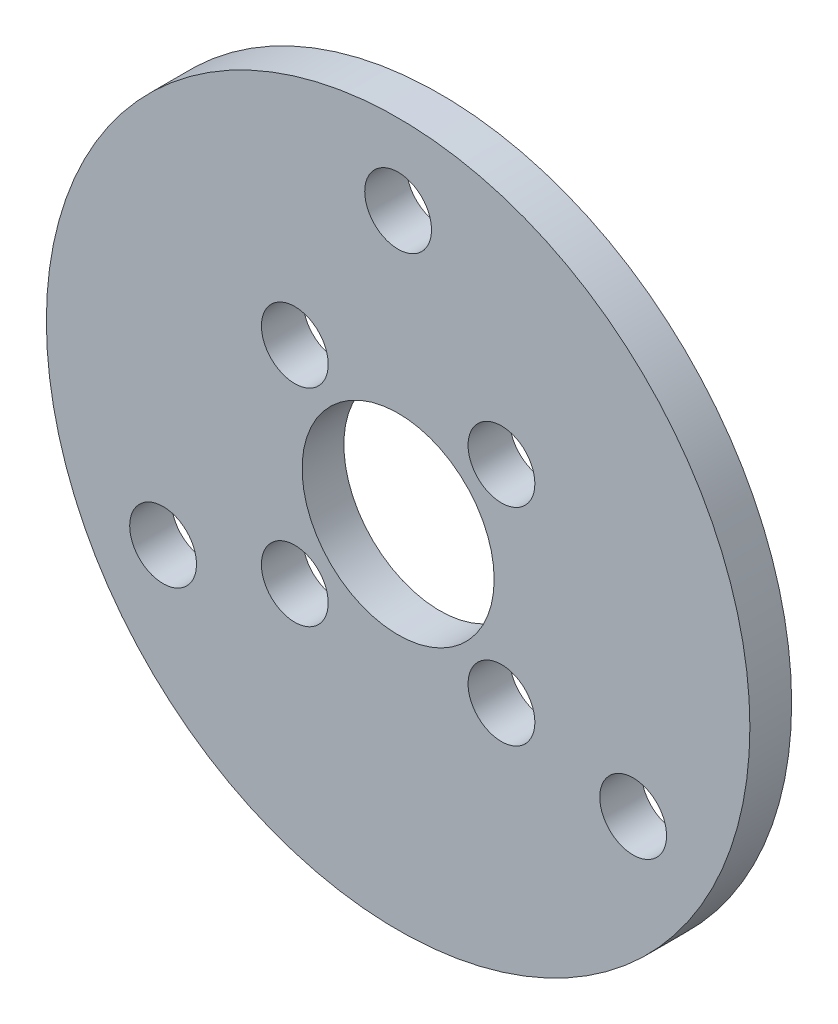
ISO-10303-21;
HEADER;
FILE_DESCRIPTION(('STEP AP214'),'2;1');
FILE_NAME('part.step','',(''),(''),'','','');
FILE_SCHEMA(('AUTOMOTIVE_DESIGN { 1 0 10303 214 1 1 1 1 }'));
ENDSEC;
DATA;
#1=APPLICATION_CONTEXT('core data for automotive mechanical design processes');
#2=APPLICATION_PROTOCOL_DEFINITION('international standard','automotive_design',2000,#1);
#3=PRODUCT_CONTEXT('',#1,'mechanical');
#4=PRODUCT('Part','Part','',(#3));
#5=PRODUCT_RELATED_PRODUCT_CATEGORY('part','',(#4));
#6=PRODUCT_DEFINITION_FORMATION('','',#4);
#7=PRODUCT_DEFINITION_CONTEXT('part definition',#1,'design');
#8=PRODUCT_DEFINITION('design','',#6,#7);
#9=PRODUCT_DEFINITION_SHAPE('','',#8);
#10=(LENGTH_UNIT() NAMED_UNIT(*) SI_UNIT(.MILLI.,.METRE.));
#11=(NAMED_UNIT(*) PLANE_ANGLE_UNIT() SI_UNIT($,.RADIAN.));
#12=(NAMED_UNIT(*) SI_UNIT($,.STERADIAN.) SOLID_ANGLE_UNIT());
#13=UNCERTAINTY_MEASURE_WITH_UNIT(LENGTH_MEASURE(1.E-05),#10,'distance_accuracy_value','');
#14=(GEOMETRIC_REPRESENTATION_CONTEXT(3) GLOBAL_UNCERTAINTY_ASSIGNED_CONTEXT((#13)) GLOBAL_UNIT_ASSIGNED_CONTEXT((#10,
#11,#12)) REPRESENTATION_CONTEXT('',''));
#15=CARTESIAN_POINT('',(0.,0.,0.));
#16=DIRECTION('',(0.,0.,1.));
#17=DIRECTION('',(1.,0.,0.));
#18=AXIS2_PLACEMENT_3D('',#15,#16,#17);
#19=CARTESIAN_POINT('',(0.,0.,2.));
#20=DIRECTION('',(0.,0.,-1.));
#21=DIRECTION('',(-1.,0.,0.));
#22=AXIS2_PLACEMENT_3D('',#19,#20,#21);
#23=CYLINDRICAL_SURFACE('',#22,4.6);
#24=CARTESIAN_POINT('',(0.,0.,2.));
#25=DIRECTION('',(0.,0.,1.));
#26=DIRECTION('',(1.,0.,0.));
#27=AXIS2_PLACEMENT_3D('',#24,#25,#26);
#28=CIRCLE('',#27,4.6);
#29=CARTESIAN_POINT('',(4.6,0.,2.));
#30=VERTEX_POINT('',#29);
#31=EDGE_CURVE('E48',#30,#30,#28,.T.);
#32=ORIENTED_EDGE('',*,*,#31,.T.);
#33=EDGE_LOOP('',(#32));
#34=FACE_BOUND('',#33,.T.);
#35=CARTESIAN_POINT('',(0.,0.,0.));
#36=DIRECTION('',(0.,0.,1.));
#37=DIRECTION('',(1.,0.,0.));
#38=AXIS2_PLACEMENT_3D('',#35,#36,#37);
#39=CIRCLE('',#38,4.6);
#40=CARTESIAN_POINT('',(4.6,0.,0.));
#41=VERTEX_POINT('',#40);
#42=EDGE_CURVE('E74',#41,#41,#39,.T.);
#43=ORIENTED_EDGE('',*,*,#42,.F.);
#44=EDGE_LOOP('',(#43));
#45=FACE_BOUND('',#44,.T.);
#46=ADVANCED_FACE('F39',(#34,#45),#23,.F.);
#47=CARTESIAN_POINT('',(4.94974746830584,4.94974746830583,2.));
#48=DIRECTION('',(0.,0.,-1.));
#49=DIRECTION('',(-1.,0.,0.));
#50=AXIS2_PLACEMENT_3D('',#47,#48,#49);
#51=CYLINDRICAL_SURFACE('',#50,1.6);
#52=CARTESIAN_POINT('',(4.94974746830584,4.94974746830583,2.));
#53=DIRECTION('',(0.,0.,1.));
#54=DIRECTION('',(1.,0.,0.));
#55=AXIS2_PLACEMENT_3D('',#52,#53,#54);
#56=CIRCLE('',#55,1.6);
#57=CARTESIAN_POINT('',(6.54974746830584,4.94974746830583,2.));
#58=VERTEX_POINT('',#57);
#59=EDGE_CURVE('E54',#58,#58,#56,.T.);
#60=ORIENTED_EDGE('',*,*,#59,.T.);
#61=EDGE_LOOP('',(#60));
#62=FACE_BOUND('',#61,.T.);
#63=CARTESIAN_POINT('',(4.94974746830584,4.94974746830583,0.));
#64=DIRECTION('',(0.,0.,1.));
#65=DIRECTION('',(1.,0.,0.));
#66=AXIS2_PLACEMENT_3D('',#63,#64,#65);
#67=CIRCLE('',#66,1.6);
#68=CARTESIAN_POINT('',(6.54974746830584,4.94974746830583,0.));
#69=VERTEX_POINT('',#68);
#70=EDGE_CURVE('E71',#69,#69,#67,.T.);
#71=ORIENTED_EDGE('',*,*,#70,.F.);
#72=EDGE_LOOP('',(#71));
#73=FACE_BOUND('',#72,.T.);
#74=ADVANCED_FACE('F104',(#62,#73),#51,.F.);
#75=CARTESIAN_POINT('',(4.94974746830583,-4.94974746830584,2.));
#76=DIRECTION('',(0.,0.,-1.));
#77=DIRECTION('',(-1.,0.,0.));
#78=AXIS2_PLACEMENT_3D('',#75,#76,#77);
#79=CYLINDRICAL_SURFACE('',#78,1.6);
#80=CARTESIAN_POINT('',(4.94974746830583,-4.94974746830584,2.));
#81=DIRECTION('',(0.,0.,1.));
#82=DIRECTION('',(1.,0.,0.));
#83=AXIS2_PLACEMENT_3D('',#80,#81,#82);
#84=CIRCLE('',#83,1.6);
#85=CARTESIAN_POINT('',(6.54974746830583,-4.94974746830584,2.));
#86=VERTEX_POINT('',#85);
#87=EDGE_CURVE('E92',#86,#86,#84,.T.);
#88=ORIENTED_EDGE('',*,*,#87,.T.);
#89=EDGE_LOOP('',(#88));
#90=FACE_BOUND('',#89,.T.);
#91=CARTESIAN_POINT('',(4.94974746830583,-4.94974746830584,0.));
#92=DIRECTION('',(0.,0.,1.));
#93=DIRECTION('',(1.,0.,0.));
#94=AXIS2_PLACEMENT_3D('',#91,#92,#93);
#95=CIRCLE('',#94,1.6);
#96=CARTESIAN_POINT('',(6.54974746830583,-4.94974746830584,0.));
#97=VERTEX_POINT('',#96);
#98=EDGE_CURVE('E67',#97,#97,#95,.T.);
#99=ORIENTED_EDGE('',*,*,#98,.F.);
#100=EDGE_LOOP('',(#99));
#101=FACE_BOUND('',#100,.T.);
#102=ADVANCED_FACE('F122',(#90,#101),#79,.F.);
#103=CARTESIAN_POINT('',(-4.94974746830584,-4.94974746830583,2.));
#104=DIRECTION('',(0.,0.,-1.));
#105=DIRECTION('',(-1.,0.,0.));
#106=AXIS2_PLACEMENT_3D('',#103,#104,#105);
#107=CYLINDRICAL_SURFACE('',#106,1.6);
#108=CARTESIAN_POINT('',(-4.94974746830584,-4.94974746830583,2.));
#109=DIRECTION('',(0.,0.,1.));
#110=DIRECTION('',(1.,0.,0.));
#111=AXIS2_PLACEMENT_3D('',#108,#109,#110);
#112=CIRCLE('',#111,1.6);
#113=CARTESIAN_POINT('',(-3.34974746830584,-4.94974746830583,2.));
#114=VERTEX_POINT('',#113);
#115=EDGE_CURVE('E86',#114,#114,#112,.T.);
#116=ORIENTED_EDGE('',*,*,#115,.T.);
#117=EDGE_LOOP('',(#116));
#118=FACE_BOUND('',#117,.T.);
#119=CARTESIAN_POINT('',(-4.94974746830584,-4.94974746830583,0.));
#120=DIRECTION('',(0.,0.,1.));
#121=DIRECTION('',(1.,0.,0.));
#122=AXIS2_PLACEMENT_3D('',#119,#120,#121);
#123=CIRCLE('',#122,1.6);
#124=CARTESIAN_POINT('',(-3.34974746830584,-4.94974746830583,0.));
#125=VERTEX_POINT('',#124);
#126=EDGE_CURVE('E62',#125,#125,#123,.T.);
#127=ORIENTED_EDGE('',*,*,#126,.F.);
#128=EDGE_LOOP('',(#127));
#129=FACE_BOUND('',#128,.T.);
#130=ADVANCED_FACE('F128',(#118,#129),#107,.F.);
#131=CARTESIAN_POINT('',(-4.94974746830583,4.94974746830584,2.));
#132=DIRECTION('',(0.,0.,-1.));
#133=DIRECTION('',(-1.,0.,0.));
#134=AXIS2_PLACEMENT_3D('',#131,#132,#133);
#135=CYLINDRICAL_SURFACE('',#134,1.6);
#136=CARTESIAN_POINT('',(-4.94974746830583,4.94974746830584,2.));
#137=DIRECTION('',(0.,0.,1.));
#138=DIRECTION('',(1.,0.,0.));
#139=AXIS2_PLACEMENT_3D('',#136,#137,#138);
#140=CIRCLE('',#139,1.6);
#141=CARTESIAN_POINT('',(-3.34974746830583,4.94974746830584,2.));
#142=VERTEX_POINT('',#141);
#143=EDGE_CURVE('E81',#142,#142,#140,.T.);
#144=ORIENTED_EDGE('',*,*,#143,.T.);
#145=EDGE_LOOP('',(#144));
#146=FACE_BOUND('',#145,.T.);
#147=CARTESIAN_POINT('',(-4.94974746830583,4.94974746830584,0.));
#148=DIRECTION('',(0.,0.,1.));
#149=DIRECTION('',(1.,0.,0.));
#150=AXIS2_PLACEMENT_3D('',#147,#148,#149);
#151=CIRCLE('',#150,1.6);
#152=CARTESIAN_POINT('',(-3.34974746830583,4.94974746830584,0.));
#153=VERTEX_POINT('',#152);
#154=EDGE_CURVE('E58',#153,#153,#151,.T.);
#155=ORIENTED_EDGE('',*,*,#154,.F.);
#156=EDGE_LOOP('',(#155));
#157=FACE_BOUND('',#156,.T.);
#158=ADVANCED_FACE('F41',(#146,#157),#135,.F.);
#159=CARTESIAN_POINT('',(0.,0.,2.));
#160=DIRECTION('',(0.,0.,-1.));
#161=DIRECTION('',(-1.,0.,0.));
#162=AXIS2_PLACEMENT_3D('',#159,#160,#161);
#163=CYLINDRICAL_SURFACE('',#162,16.85);
#164=CARTESIAN_POINT('',(0.,0.,2.));
#165=DIRECTION('',(0.,0.,1.));
#166=DIRECTION('',(1.,0.,0.));
#167=AXIS2_PLACEMENT_3D('',#164,#165,#166);
#168=CIRCLE('',#167,16.85);
#169=CARTESIAN_POINT('',(16.85,0.,2.));
#170=VERTEX_POINT('',#169);
#171=EDGE_CURVE('E10',#170,#170,#168,.T.);
#172=ORIENTED_EDGE('',*,*,#171,.F.);
#173=EDGE_LOOP('',(#172));
#174=FACE_BOUND('',#173,.T.);
#175=CARTESIAN_POINT('',(0.,0.,0.));
#176=DIRECTION('',(0.,0.,1.));
#177=DIRECTION('',(1.,0.,0.));
#178=AXIS2_PLACEMENT_3D('',#175,#176,#177);
#179=CIRCLE('',#178,16.85);
#180=CARTESIAN_POINT('',(16.85,0.,0.));
#181=VERTEX_POINT('',#180);
#182=EDGE_CURVE('E43',#181,#181,#179,.T.);
#183=ORIENTED_EDGE('',*,*,#182,.T.);
#184=EDGE_LOOP('',(#183));
#185=FACE_BOUND('',#184,.T.);
#186=ADVANCED_FACE('F111',(#174,#185),#163,.T.);
#187=CARTESIAN_POINT('',(0.,0.,2.));
#188=DIRECTION('',(0.,0.,1.));
#189=DIRECTION('',(1.,0.,0.));
#190=AXIS2_PLACEMENT_3D('',#187,#188,#189);
#191=PLANE('',#190);
#192=CARTESIAN_POINT('',(0.,13.,2.));
#193=DIRECTION('',(0.,0.,-1.));
#194=DIRECTION('',(-1.,0.,0.));
#195=AXIS2_PLACEMENT_3D('',#192,#193,#194);
#196=CIRCLE('',#195,1.6);
#197=CARTESIAN_POINT('',(-1.6,13.,2.));
#198=VERTEX_POINT('',#197);
#199=EDGE_CURVE('E63',#198,#198,#196,.T.);
#200=ORIENTED_EDGE('',*,*,#199,.T.);
#201=EDGE_LOOP('',(#200));
#202=FACE_BOUND('',#201,.T.);
#203=CARTESIAN_POINT('',(11.2583302491978,-6.50000000000011,2.));
#204=DIRECTION('',(0.,0.,-1.));
#205=DIRECTION('',(-1.,0.,0.));
#206=AXIS2_PLACEMENT_3D('',#203,#204,#205);
#207=CIRCLE('',#206,1.6);
#208=CARTESIAN_POINT('',(9.65833024919777,-6.50000000000011,2.));
#209=VERTEX_POINT('',#208);
#210=EDGE_CURVE('E171',#209,#209,#207,.T.);
#211=ORIENTED_EDGE('',*,*,#210,.T.);
#212=EDGE_LOOP('',(#211));
#213=FACE_BOUND('',#212,.T.);
#214=CARTESIAN_POINT('',(-11.2583302491978,-6.50000000000011,2.));
#215=DIRECTION('',(0.,0.,-1.));
#216=DIRECTION('',(-1.,0.,0.));
#217=AXIS2_PLACEMENT_3D('',#214,#215,#216);
#218=CIRCLE('',#217,1.6);
#219=CARTESIAN_POINT('',(-12.8583302491978,-6.50000000000011,2.));
#220=VERTEX_POINT('',#219);
#221=EDGE_CURVE('E182',#220,#220,#218,.T.);
#222=ORIENTED_EDGE('',*,*,#221,.T.);
#223=EDGE_LOOP('',(#222));
#224=FACE_BOUND('',#223,.T.);
#225=ORIENTED_EDGE('',*,*,#143,.F.);
#226=EDGE_LOOP('',(#225));
#227=FACE_BOUND('',#226,.T.);
#228=ORIENTED_EDGE('',*,*,#115,.F.);
#229=EDGE_LOOP('',(#228));
#230=FACE_BOUND('',#229,.T.);
#231=ORIENTED_EDGE('',*,*,#87,.F.);
#232=EDGE_LOOP('',(#231));
#233=FACE_BOUND('',#232,.T.);
#234=ORIENTED_EDGE('',*,*,#59,.F.);
#235=EDGE_LOOP('',(#234));
#236=FACE_BOUND('',#235,.T.);
#237=ORIENTED_EDGE('',*,*,#31,.F.);
#238=EDGE_LOOP('',(#237));
#239=FACE_BOUND('',#238,.T.);
#240=ORIENTED_EDGE('',*,*,#171,.T.);
#241=EDGE_LOOP('',(#240));
#242=FACE_BOUND('',#241,.T.);
#243=ADVANCED_FACE('F107',(#202,#213,#224,#227,#230,#233,#236,#239,#242),#191,.T.);
#244=CARTESIAN_POINT('',(0.,0.,0.));
#245=DIRECTION('',(0.,0.,1.));
#246=DIRECTION('',(1.,0.,0.));
#247=AXIS2_PLACEMENT_3D('',#244,#245,#246);
#248=PLANE('',#247);
#249=CARTESIAN_POINT('',(0.,13.,0.));
#250=DIRECTION('',(0.,0.,-1.));
#251=DIRECTION('',(-1.,0.,0.));
#252=AXIS2_PLACEMENT_3D('',#249,#250,#251);
#253=CIRCLE('',#252,1.6);
#254=CARTESIAN_POINT('',(-1.6,13.,0.));
#255=VERTEX_POINT('',#254);
#256=EDGE_CURVE('E169',#255,#255,#253,.T.);
#257=ORIENTED_EDGE('',*,*,#256,.F.);
#258=EDGE_LOOP('',(#257));
#259=FACE_BOUND('',#258,.T.);
#260=CARTESIAN_POINT('',(11.2583302491978,-6.50000000000011,0.));
#261=DIRECTION('',(0.,0.,-1.));
#262=DIRECTION('',(-1.,0.,0.));
#263=AXIS2_PLACEMENT_3D('',#260,#261,#262);
#264=CIRCLE('',#263,1.6);
#265=CARTESIAN_POINT('',(9.65833024919777,-6.50000000000011,0.));
#266=VERTEX_POINT('',#265);
#267=EDGE_CURVE('E177',#266,#266,#264,.T.);
#268=ORIENTED_EDGE('',*,*,#267,.F.);
#269=EDGE_LOOP('',(#268));
#270=FACE_BOUND('',#269,.T.);
#271=CARTESIAN_POINT('',(-11.2583302491978,-6.50000000000011,0.));
#272=DIRECTION('',(0.,0.,-1.));
#273=DIRECTION('',(-1.,0.,0.));
#274=AXIS2_PLACEMENT_3D('',#271,#272,#273);
#275=CIRCLE('',#274,1.6);
#276=CARTESIAN_POINT('',(-12.8583302491978,-6.50000000000011,0.));
#277=VERTEX_POINT('',#276);
#278=EDGE_CURVE('E95',#277,#277,#275,.T.);
#279=ORIENTED_EDGE('',*,*,#278,.F.);
#280=EDGE_LOOP('',(#279));
#281=FACE_BOUND('',#280,.T.);
#282=ORIENTED_EDGE('',*,*,#154,.T.);
#283=EDGE_LOOP('',(#282));
#284=FACE_BOUND('',#283,.T.);
#285=ORIENTED_EDGE('',*,*,#126,.T.);
#286=EDGE_LOOP('',(#285));
#287=FACE_BOUND('',#286,.T.);
#288=ORIENTED_EDGE('',*,*,#98,.T.);
#289=EDGE_LOOP('',(#288));
#290=FACE_BOUND('',#289,.T.);
#291=ORIENTED_EDGE('',*,*,#70,.T.);
#292=EDGE_LOOP('',(#291));
#293=FACE_BOUND('',#292,.T.);
#294=ORIENTED_EDGE('',*,*,#42,.T.);
#295=EDGE_LOOP('',(#294));
#296=FACE_BOUND('',#295,.T.);
#297=ORIENTED_EDGE('',*,*,#182,.F.);
#298=EDGE_LOOP('',(#297));
#299=FACE_BOUND('',#298,.T.);
#300=ADVANCED_FACE('F110',(#259,#270,#281,#284,#287,#290,#293,#296,#299),#248,.F.);
#301=CARTESIAN_POINT('',(-11.2583302491978,-6.50000000000011,2.));
#302=DIRECTION('',(0.,0.,-1.));
#303=DIRECTION('',(-1.,0.,0.));
#304=AXIS2_PLACEMENT_3D('',#301,#302,#303);
#305=CYLINDRICAL_SURFACE('',#304,1.6);
#306=ORIENTED_EDGE('',*,*,#221,.F.);
#307=EDGE_LOOP('',(#306));
#308=FACE_BOUND('',#307,.T.);
#309=ORIENTED_EDGE('',*,*,#278,.T.);
#310=EDGE_LOOP('',(#309));
#311=FACE_BOUND('',#310,.T.);
#312=ADVANCED_FACE('F141',(#308,#311),#305,.F.);
#313=CARTESIAN_POINT('',(11.2583302491978,-6.50000000000011,2.));
#314=DIRECTION('',(0.,0.,-1.));
#315=DIRECTION('',(-1.,0.,0.));
#316=AXIS2_PLACEMENT_3D('',#313,#314,#315);
#317=CYLINDRICAL_SURFACE('',#316,1.6);
#318=ORIENTED_EDGE('',*,*,#210,.F.);
#319=EDGE_LOOP('',(#318));
#320=FACE_BOUND('',#319,.T.);
#321=ORIENTED_EDGE('',*,*,#267,.T.);
#322=EDGE_LOOP('',(#321));
#323=FACE_BOUND('',#322,.T.);
#324=ADVANCED_FACE('F151',(#320,#323),#317,.F.);
#325=CARTESIAN_POINT('',(0.,13.,2.));
#326=DIRECTION('',(0.,0.,-1.));
#327=DIRECTION('',(-1.,0.,0.));
#328=AXIS2_PLACEMENT_3D('',#325,#326,#327);
#329=CYLINDRICAL_SURFACE('',#328,1.6);
#330=ORIENTED_EDGE('',*,*,#199,.F.);
#331=EDGE_LOOP('',(#330));
#332=FACE_BOUND('',#331,.T.);
#333=ORIENTED_EDGE('',*,*,#256,.T.);
#334=EDGE_LOOP('',(#333));
#335=FACE_BOUND('',#334,.T.);
#336=ADVANCED_FACE('F159',(#332,#335),#329,.F.);
#337=CLOSED_SHELL('',(#46,#74,#102,#130,#158,#186,#243,#300,#312,#324,#336));
#338=MANIFOLD_SOLID_BREP('B2',#337);
#339=ADVANCED_BREP_SHAPE_REPRESENTATION('',(#18,#338),#14);
#340=SHAPE_DEFINITION_REPRESENTATION(#9,#339);
ENDSEC;
END-ISO-10303-21;
